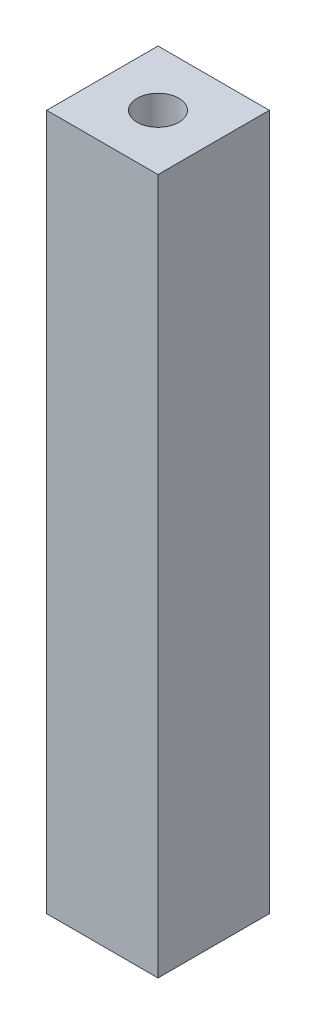
ISO-10303-21;
HEADER;
FILE_DESCRIPTION(('STEP AP214'),'2;1');
FILE_NAME('part.step','',(''),(''),'','','');
FILE_SCHEMA(('AUTOMOTIVE_DESIGN { 1 0 10303 214 1 1 1 1 }'));
ENDSEC;
DATA;
#1=APPLICATION_CONTEXT('core data for automotive mechanical design processes');
#2=APPLICATION_PROTOCOL_DEFINITION('international standard','automotive_design',2000,#1);
#3=PRODUCT_CONTEXT('',#1,'mechanical');
#4=PRODUCT('Part','Part','',(#3));
#5=PRODUCT_RELATED_PRODUCT_CATEGORY('part','',(#4));
#6=PRODUCT_DEFINITION_FORMATION('','',#4);
#7=PRODUCT_DEFINITION_CONTEXT('part definition',#1,'design');
#8=PRODUCT_DEFINITION('design','',#6,#7);
#9=PRODUCT_DEFINITION_SHAPE('','',#8);
#10=(LENGTH_UNIT() NAMED_UNIT(*) SI_UNIT(.MILLI.,.METRE.));
#11=(NAMED_UNIT(*) PLANE_ANGLE_UNIT() SI_UNIT($,.RADIAN.));
#12=(NAMED_UNIT(*) SI_UNIT($,.STERADIAN.) SOLID_ANGLE_UNIT());
#13=UNCERTAINTY_MEASURE_WITH_UNIT(LENGTH_MEASURE(1.E-05),#10,'distance_accuracy_value','');
#14=(GEOMETRIC_REPRESENTATION_CONTEXT(3) GLOBAL_UNCERTAINTY_ASSIGNED_CONTEXT((#13)) GLOBAL_UNIT_ASSIGNED_CONTEXT((#10,
#11,#12)) REPRESENTATION_CONTEXT('',''));
#15=CARTESIAN_POINT('',(0.,0.,0.));
#16=DIRECTION('',(0.,0.,1.));
#17=DIRECTION('',(1.,0.,0.));
#18=AXIS2_PLACEMENT_3D('',#15,#16,#17);
#19=CARTESIAN_POINT('',(4.,50.,4.));
#20=DIRECTION('',(-1.,0.,0.));
#21=DIRECTION('',(0.,0.,1.));
#22=AXIS2_PLACEMENT_3D('',#19,#20,#21);
#23=PLANE('',#22);
#24=DIRECTION('',(0.,0.,-1.));
#25=VECTOR('',#24,1.);
#26=CARTESIAN_POINT('',(4.,0.,4.));
#27=LINE('',#26,#25);
#28=CARTESIAN_POINT('',(4.,0.,4.));
#29=VERTEX_POINT('',#28);
#30=CARTESIAN_POINT('',(4.,0.,-4.));
#31=VERTEX_POINT('',#30);
#32=EDGE_CURVE('E96',#29,#31,#27,.T.);
#33=ORIENTED_EDGE('',*,*,#32,.T.);
#34=DIRECTION('',(0.,-1.,0.));
#35=VECTOR('',#34,1.);
#36=CARTESIAN_POINT('',(4.,50.,-4.));
#37=LINE('',#36,#35);
#38=CARTESIAN_POINT('',(4.,50.,-4.));
#39=VERTEX_POINT('',#38);
#40=EDGE_CURVE('E11',#39,#31,#37,.T.);
#41=ORIENTED_EDGE('',*,*,#40,.F.);
#42=DIRECTION('',(0.,0.,-1.));
#43=VECTOR('',#42,1.);
#44=CARTESIAN_POINT('',(4.,50.,4.));
#45=LINE('',#44,#43);
#46=CARTESIAN_POINT('',(4.,50.,4.));
#47=VERTEX_POINT('',#46);
#48=EDGE_CURVE('E84',#47,#39,#45,.T.);
#49=ORIENTED_EDGE('',*,*,#48,.F.);
#50=DIRECTION('',(0.,-1.,0.));
#51=VECTOR('',#50,1.);
#52=CARTESIAN_POINT('',(4.,50.,4.));
#53=LINE('',#52,#51);
#54=EDGE_CURVE('E92',#47,#29,#53,.T.);
#55=ORIENTED_EDGE('',*,*,#54,.T.);
#56=EDGE_LOOP('',(#33,#41,#49,#55));
#57=FACE_BOUND('',#56,.T.);
#58=ADVANCED_FACE('F33',(#57),#23,.F.);
#59=CARTESIAN_POINT('',(-4.,50.,-4.));
#60=DIRECTION('',(0.,0.,1.));
#61=DIRECTION('',(1.,0.,0.));
#62=AXIS2_PLACEMENT_3D('',#59,#60,#61);
#63=PLANE('',#62);
#64=DIRECTION('',(-1.,0.,0.));
#65=VECTOR('',#64,1.);
#66=CARTESIAN_POINT('',(-4.,0.,-4.));
#67=LINE('',#66,#65);
#68=CARTESIAN_POINT('',(-4.,0.,-4.));
#69=VERTEX_POINT('',#68);
#70=EDGE_CURVE('E88',#31,#69,#67,.T.);
#71=ORIENTED_EDGE('',*,*,#70,.T.);
#72=DIRECTION('',(0.,-1.,0.));
#73=VECTOR('',#72,1.);
#74=CARTESIAN_POINT('',(-4.,50.,-4.));
#75=LINE('',#74,#73);
#76=CARTESIAN_POINT('',(-4.,50.,-4.));
#77=VERTEX_POINT('',#76);
#78=EDGE_CURVE('E41',#77,#69,#75,.T.);
#79=ORIENTED_EDGE('',*,*,#78,.F.);
#80=DIRECTION('',(-1.,0.,0.));
#81=VECTOR('',#80,1.);
#82=CARTESIAN_POINT('',(-4.,50.,-4.));
#83=LINE('',#82,#81);
#84=EDGE_CURVE('E79',#39,#77,#83,.T.);
#85=ORIENTED_EDGE('',*,*,#84,.F.);
#86=ORIENTED_EDGE('',*,*,#40,.T.);
#87=EDGE_LOOP('',(#71,#79,#85,#86));
#88=FACE_BOUND('',#87,.T.);
#89=ADVANCED_FACE('F87',(#88),#63,.F.);
#90=CARTESIAN_POINT('',(-4.,50.,4.));
#91=DIRECTION('',(1.,0.,0.));
#92=DIRECTION('',(0.,0.,-1.));
#93=AXIS2_PLACEMENT_3D('',#90,#91,#92);
#94=PLANE('',#93);
#95=DIRECTION('',(0.,0.,1.));
#96=VECTOR('',#95,1.);
#97=CARTESIAN_POINT('',(-4.,0.,4.));
#98=LINE('',#97,#96);
#99=CARTESIAN_POINT('',(-4.,0.,4.));
#100=VERTEX_POINT('',#99);
#101=EDGE_CURVE('E66',#69,#100,#98,.T.);
#102=ORIENTED_EDGE('',*,*,#101,.T.);
#103=DIRECTION('',(0.,-1.,0.));
#104=VECTOR('',#103,1.);
#105=CARTESIAN_POINT('',(-4.,50.,4.));
#106=LINE('',#105,#104);
#107=CARTESIAN_POINT('',(-4.,50.,4.));
#108=VERTEX_POINT('',#107);
#109=EDGE_CURVE('E89',#108,#100,#106,.T.);
#110=ORIENTED_EDGE('',*,*,#109,.F.);
#111=DIRECTION('',(0.,0.,1.));
#112=VECTOR('',#111,1.);
#113=CARTESIAN_POINT('',(-4.,50.,4.));
#114=LINE('',#113,#112);
#115=EDGE_CURVE('E82',#77,#108,#114,.T.);
#116=ORIENTED_EDGE('',*,*,#115,.F.);
#117=ORIENTED_EDGE('',*,*,#78,.T.);
#118=EDGE_LOOP('',(#102,#110,#116,#117));
#119=FACE_BOUND('',#118,.T.);
#120=ADVANCED_FACE('F90',(#119),#94,.F.);
#121=CARTESIAN_POINT('',(-4.,50.,4.));
#122=DIRECTION('',(0.,0.,-1.));
#123=DIRECTION('',(-1.,0.,0.));
#124=AXIS2_PLACEMENT_3D('',#121,#122,#123);
#125=PLANE('',#124);
#126=DIRECTION('',(1.,0.,0.));
#127=VECTOR('',#126,1.);
#128=CARTESIAN_POINT('',(-4.,0.,4.));
#129=LINE('',#128,#127);
#130=EDGE_CURVE('E72',#100,#29,#129,.T.);
#131=ORIENTED_EDGE('',*,*,#130,.T.);
#132=ORIENTED_EDGE('',*,*,#54,.F.);
#133=DIRECTION('',(1.,0.,0.));
#134=VECTOR('',#133,1.);
#135=CARTESIAN_POINT('',(-4.,50.,4.));
#136=LINE('',#135,#134);
#137=EDGE_CURVE('E49',#108,#47,#136,.T.);
#138=ORIENTED_EDGE('',*,*,#137,.F.);
#139=ORIENTED_EDGE('',*,*,#109,.T.);
#140=EDGE_LOOP('',(#131,#132,#138,#139));
#141=FACE_BOUND('',#140,.T.);
#142=ADVANCED_FACE('F104',(#141),#125,.F.);
#143=CARTESIAN_POINT('',(0.,50.,0.));
#144=DIRECTION('',(0.,-1.,0.));
#145=DIRECTION('',(0.,0.,-1.));
#146=AXIS2_PLACEMENT_3D('',#143,#144,#145);
#147=PLANE('',#146);
#148=CARTESIAN_POINT('',(0.,50.,0.));
#149=DIRECTION('',(0.,1.,0.));
#150=DIRECTION('',(0.,0.,1.));
#151=AXIS2_PLACEMENT_3D('',#148,#149,#150);
#152=CIRCLE('',#151,1.5);
#153=CARTESIAN_POINT('',(0.,50.,1.5));
#154=VERTEX_POINT('',#153);
#155=EDGE_CURVE('E110',#154,#154,#152,.T.);
#156=ORIENTED_EDGE('',*,*,#155,.F.);
#157=EDGE_LOOP('',(#156));
#158=FACE_BOUND('',#157,.T.);
#159=ORIENTED_EDGE('',*,*,#48,.T.);
#160=ORIENTED_EDGE('',*,*,#84,.T.);
#161=ORIENTED_EDGE('',*,*,#115,.T.);
#162=ORIENTED_EDGE('',*,*,#137,.T.);
#163=EDGE_LOOP('',(#159,#160,#161,#162));
#164=FACE_BOUND('',#163,.T.);
#165=ADVANCED_FACE('F80',(#158,#164),#147,.F.);
#166=CARTESIAN_POINT('',(0.,0.,0.));
#167=DIRECTION('',(0.,-1.,0.));
#168=DIRECTION('',(0.,0.,-1.));
#169=AXIS2_PLACEMENT_3D('',#166,#167,#168);
#170=PLANE('',#169);
#171=CARTESIAN_POINT('',(0.,0.,0.));
#172=DIRECTION('',(0.,1.,0.));
#173=DIRECTION('',(0.,0.,1.));
#174=AXIS2_PLACEMENT_3D('',#171,#172,#173);
#175=CIRCLE('',#174,1.5);
#176=CARTESIAN_POINT('',(0.,0.,1.5));
#177=VERTEX_POINT('',#176);
#178=EDGE_CURVE('E99',#177,#177,#175,.T.);
#179=ORIENTED_EDGE('',*,*,#178,.T.);
#180=EDGE_LOOP('',(#179));
#181=FACE_BOUND('',#180,.T.);
#182=ORIENTED_EDGE('',*,*,#32,.F.);
#183=ORIENTED_EDGE('',*,*,#130,.F.);
#184=ORIENTED_EDGE('',*,*,#101,.F.);
#185=ORIENTED_EDGE('',*,*,#70,.F.);
#186=EDGE_LOOP('',(#182,#183,#184,#185));
#187=FACE_BOUND('',#186,.T.);
#188=ADVANCED_FACE('F107',(#181,#187),#170,.T.);
#189=CARTESIAN_POINT('',(0.,0.,0.));
#190=DIRECTION('',(0.,1.,0.));
#191=DIRECTION('',(0.,0.,1.));
#192=AXIS2_PLACEMENT_3D('',#189,#190,#191);
#193=CYLINDRICAL_SURFACE('',#192,1.5);
#194=ORIENTED_EDGE('',*,*,#178,.F.);
#195=EDGE_LOOP('',(#194));
#196=FACE_BOUND('',#195,.T.);
#197=ORIENTED_EDGE('',*,*,#155,.T.);
#198=EDGE_LOOP('',(#197));
#199=FACE_BOUND('',#198,.T.);
#200=ADVANCED_FACE('F117',(#196,#199),#193,.F.);
#201=CLOSED_SHELL('',(#58,#89,#120,#142,#165,#188,#200));
#202=MANIFOLD_SOLID_BREP('B2',#201);
#203=ADVANCED_BREP_SHAPE_REPRESENTATION('',(#18,#202),#14);
#204=SHAPE_DEFINITION_REPRESENTATION(#9,#203);
ENDSEC;
END-ISO-10303-21;
